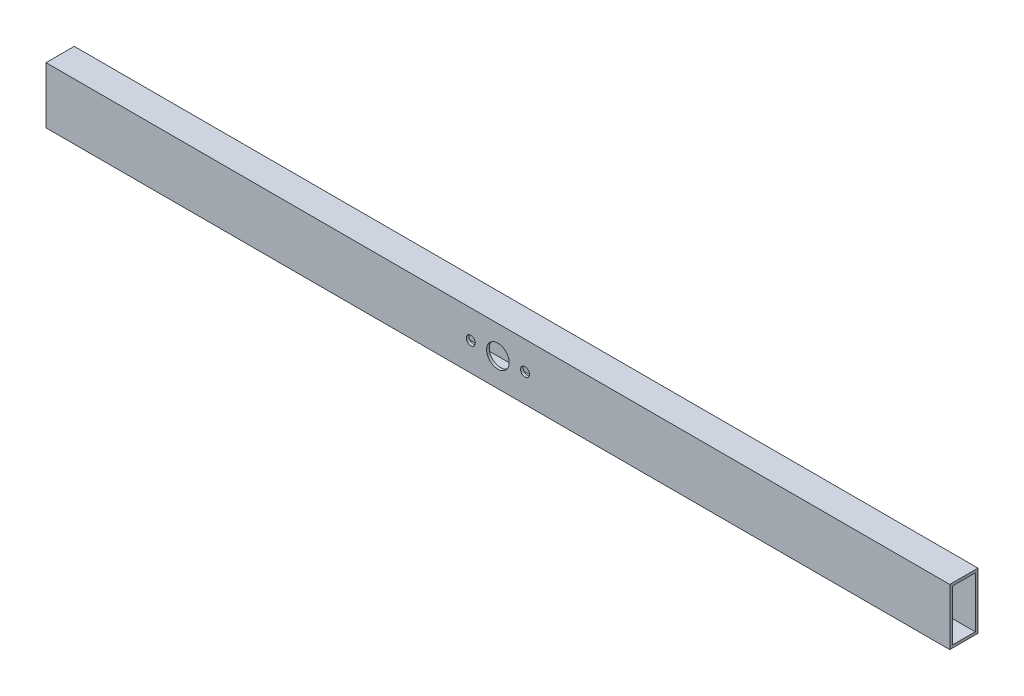
ISO-10303-21;
HEADER;
FILE_DESCRIPTION(('STEP AP214'),'2;1');
FILE_NAME('part.step','',(''),(''),'','','');
FILE_SCHEMA(('AUTOMOTIVE_DESIGN { 1 0 10303 214 1 1 1 1 }'));
ENDSEC;
DATA;
#1=APPLICATION_CONTEXT('core data for automotive mechanical design processes');
#2=APPLICATION_PROTOCOL_DEFINITION('international standard','automotive_design',2000,#1);
#3=PRODUCT_CONTEXT('',#1,'mechanical');
#4=PRODUCT('Part','Part','',(#3));
#5=PRODUCT_RELATED_PRODUCT_CATEGORY('part','',(#4));
#6=PRODUCT_DEFINITION_FORMATION('','',#4);
#7=PRODUCT_DEFINITION_CONTEXT('part definition',#1,'design');
#8=PRODUCT_DEFINITION('design','',#6,#7);
#9=PRODUCT_DEFINITION_SHAPE('','',#8);
#10=(LENGTH_UNIT() NAMED_UNIT(*) SI_UNIT(.MILLI.,.METRE.));
#11=(NAMED_UNIT(*) PLANE_ANGLE_UNIT() SI_UNIT($,.RADIAN.));
#12=(NAMED_UNIT(*) SI_UNIT($,.STERADIAN.) SOLID_ANGLE_UNIT());
#13=UNCERTAINTY_MEASURE_WITH_UNIT(LENGTH_MEASURE(1.E-05),#10,'distance_accuracy_value','');
#14=(GEOMETRIC_REPRESENTATION_CONTEXT(3) GLOBAL_UNCERTAINTY_ASSIGNED_CONTEXT((#13)) GLOBAL_UNIT_ASSIGNED_CONTEXT((#10,
#11,#12)) REPRESENTATION_CONTEXT('',''));
#15=CARTESIAN_POINT('',(0.,0.,0.));
#16=DIRECTION('',(0.,0.,1.));
#17=DIRECTION('',(1.,0.,0.));
#18=AXIS2_PLACEMENT_3D('',#15,#16,#17);
#19=CARTESIAN_POINT('',(400.,0.,0.));
#20=DIRECTION('',(-1.,0.,0.));
#21=DIRECTION('',(0.,0.,1.));
#22=AXIS2_PLACEMENT_3D('',#19,#20,#21);
#23=PLANE('',#22);
#24=DIRECTION('',(0.,1.,0.));
#25=VECTOR('',#24,1.);
#26=CARTESIAN_POINT('',(400.,-12.5,-6.25));
#27=LINE('',#26,#25);
#28=CARTESIAN_POINT('',(400.,-12.5,-6.25));
#29=VERTEX_POINT('',#28);
#30=CARTESIAN_POINT('',(400.,12.5,-6.25));
#31=VERTEX_POINT('',#30);
#32=EDGE_CURVE('E142',#29,#31,#27,.T.);
#33=ORIENTED_EDGE('',*,*,#32,.T.);
#34=DIRECTION('',(0.,0.,1.));
#35=VECTOR('',#34,1.);
#36=CARTESIAN_POINT('',(400.,12.5,6.25));
#37=LINE('',#36,#35);
#38=CARTESIAN_POINT('',(400.,12.5,6.25));
#39=VERTEX_POINT('',#38);
#40=EDGE_CURVE('E145',#31,#39,#37,.T.);
#41=ORIENTED_EDGE('',*,*,#40,.T.);
#42=DIRECTION('',(0.,-1.,0.));
#43=VECTOR('',#42,1.);
#44=CARTESIAN_POINT('',(400.,-12.5,6.25));
#45=LINE('',#44,#43);
#46=CARTESIAN_POINT('',(400.,-12.5,6.25));
#47=VERTEX_POINT('',#46);
#48=EDGE_CURVE('E148',#39,#47,#45,.T.);
#49=ORIENTED_EDGE('',*,*,#48,.T.);
#50=DIRECTION('',(0.,0.,-1.));
#51=VECTOR('',#50,1.);
#52=CARTESIAN_POINT('',(400.,-12.5,6.25));
#53=LINE('',#52,#51);
#54=EDGE_CURVE('E150',#47,#29,#53,.T.);
#55=ORIENTED_EDGE('',*,*,#54,.T.);
#56=EDGE_LOOP('',(#33,#41,#49,#55));
#57=FACE_BOUND('',#56,.T.);
#58=DIRECTION('',(0.,-1.,0.));
#59=VECTOR('',#58,1.);
#60=CARTESIAN_POINT('',(400.,-11.3,5.05));
#61=LINE('',#60,#59);
#62=CARTESIAN_POINT('',(400.,11.3,5.05));
#63=VERTEX_POINT('',#62);
#64=CARTESIAN_POINT('',(400.,-11.3,5.05));
#65=VERTEX_POINT('',#64);
#66=EDGE_CURVE('E104',#63,#65,#61,.T.);
#67=ORIENTED_EDGE('',*,*,#66,.F.);
#68=DIRECTION('',(0.,0.,1.));
#69=VECTOR('',#68,1.);
#70=CARTESIAN_POINT('',(400.,11.3,5.05));
#71=LINE('',#70,#69);
#72=CARTESIAN_POINT('',(400.,11.3,-5.05));
#73=VERTEX_POINT('',#72);
#74=EDGE_CURVE('E126',#73,#63,#71,.T.);
#75=ORIENTED_EDGE('',*,*,#74,.F.);
#76=DIRECTION('',(0.,1.,0.));
#77=VECTOR('',#76,1.);
#78=CARTESIAN_POINT('',(400.,-11.3,-5.05));
#79=LINE('',#78,#77);
#80=CARTESIAN_POINT('',(400.,-11.3,-5.05));
#81=VERTEX_POINT('',#80);
#82=EDGE_CURVE('E124',#81,#73,#79,.T.);
#83=ORIENTED_EDGE('',*,*,#82,.F.);
#84=DIRECTION('',(0.,0.,-1.));
#85=VECTOR('',#84,1.);
#86=CARTESIAN_POINT('',(400.,-11.3,5.05));
#87=LINE('',#86,#85);
#88=EDGE_CURVE('E112',#65,#81,#87,.T.);
#89=ORIENTED_EDGE('',*,*,#88,.F.);
#90=EDGE_LOOP('',(#67,#75,#83,#89));
#91=FACE_BOUND('',#90,.T.);
#92=ADVANCED_FACE('F37',(#57,#91),#23,.F.);
#93=CARTESIAN_POINT('',(0.,0.,0.));
#94=DIRECTION('',(-1.,0.,0.));
#95=DIRECTION('',(0.,0.,1.));
#96=AXIS2_PLACEMENT_3D('',#93,#94,#95);
#97=PLANE('',#96);
#98=DIRECTION('',(0.,1.,0.));
#99=VECTOR('',#98,1.);
#100=CARTESIAN_POINT('',(0.,-12.5,-6.25));
#101=LINE('',#100,#99);
#102=CARTESIAN_POINT('',(0.,-12.5,-6.25));
#103=VERTEX_POINT('',#102);
#104=CARTESIAN_POINT('',(0.,12.5,-6.25));
#105=VERTEX_POINT('',#104);
#106=EDGE_CURVE('E120',#103,#105,#101,.T.);
#107=ORIENTED_EDGE('',*,*,#106,.F.);
#108=DIRECTION('',(0.,0.,-1.));
#109=VECTOR('',#108,1.);
#110=CARTESIAN_POINT('',(0.,-12.5,6.25));
#111=LINE('',#110,#109);
#112=CARTESIAN_POINT('',(0.,-12.5,6.25));
#113=VERTEX_POINT('',#112);
#114=EDGE_CURVE('E146',#113,#103,#111,.T.);
#115=ORIENTED_EDGE('',*,*,#114,.F.);
#116=DIRECTION('',(0.,-1.,0.));
#117=VECTOR('',#116,1.);
#118=CARTESIAN_POINT('',(0.,-12.5,6.25));
#119=LINE('',#118,#117);
#120=CARTESIAN_POINT('',(0.,12.5,6.25));
#121=VERTEX_POINT('',#120);
#122=EDGE_CURVE('E157',#121,#113,#119,.T.);
#123=ORIENTED_EDGE('',*,*,#122,.F.);
#124=DIRECTION('',(0.,0.,1.));
#125=VECTOR('',#124,1.);
#126=CARTESIAN_POINT('',(0.,12.5,6.25));
#127=LINE('',#126,#125);
#128=EDGE_CURVE('E155',#105,#121,#127,.T.);
#129=ORIENTED_EDGE('',*,*,#128,.F.);
#130=EDGE_LOOP('',(#107,#115,#123,#129));
#131=FACE_BOUND('',#130,.T.);
#132=DIRECTION('',(0.,0.,1.));
#133=VECTOR('',#132,1.);
#134=CARTESIAN_POINT('',(0.,11.3,5.05));
#135=LINE('',#134,#133);
#136=CARTESIAN_POINT('',(0.,11.3,-5.05));
#137=VERTEX_POINT('',#136);
#138=CARTESIAN_POINT('',(0.,11.3,5.05));
#139=VERTEX_POINT('',#138);
#140=EDGE_CURVE('E113',#137,#139,#135,.T.);
#141=ORIENTED_EDGE('',*,*,#140,.T.);
#142=DIRECTION('',(0.,-1.,0.));
#143=VECTOR('',#142,1.);
#144=CARTESIAN_POINT('',(0.,-11.3,5.05));
#145=LINE('',#144,#143);
#146=CARTESIAN_POINT('',(0.,-11.3,5.05));
#147=VERTEX_POINT('',#146);
#148=EDGE_CURVE('E62',#139,#147,#145,.T.);
#149=ORIENTED_EDGE('',*,*,#148,.T.);
#150=DIRECTION('',(0.,0.,-1.));
#151=VECTOR('',#150,1.);
#152=CARTESIAN_POINT('',(0.,-11.3,5.05));
#153=LINE('',#152,#151);
#154=CARTESIAN_POINT('',(0.,-11.3,-5.05));
#155=VERTEX_POINT('',#154);
#156=EDGE_CURVE('E119',#147,#155,#153,.T.);
#157=ORIENTED_EDGE('',*,*,#156,.T.);
#158=DIRECTION('',(0.,1.,0.));
#159=VECTOR('',#158,1.);
#160=CARTESIAN_POINT('',(0.,-11.3,-5.05));
#161=LINE('',#160,#159);
#162=EDGE_CURVE('E134',#155,#137,#161,.T.);
#163=ORIENTED_EDGE('',*,*,#162,.T.);
#164=EDGE_LOOP('',(#141,#149,#157,#163));
#165=FACE_BOUND('',#164,.T.);
#166=ADVANCED_FACE('F215',(#131,#165),#97,.T.);
#167=CARTESIAN_POINT('',(400.,-12.5,-6.25));
#168=DIRECTION('',(0.,0.,1.));
#169=DIRECTION('',(1.,0.,0.));
#170=AXIS2_PLACEMENT_3D('',#167,#168,#169);
#171=PLANE('',#170);
#172=CARTESIAN_POINT('',(212.,0.,-6.25));
#173=DIRECTION('',(0.,0.,-1.));
#174=DIRECTION('',(-1.,0.,0.));
#175=AXIS2_PLACEMENT_3D('',#172,#173,#174);
#176=CIRCLE('',#175,2.);
#177=CARTESIAN_POINT('',(210.,0.,-6.25));
#178=VERTEX_POINT('',#177);
#179=EDGE_CURVE('E369',#178,#178,#176,.T.);
#180=ORIENTED_EDGE('',*,*,#179,.F.);
#181=EDGE_LOOP('',(#180));
#182=FACE_BOUND('',#181,.T.);
#183=CARTESIAN_POINT('',(188.,0.,-6.25));
#184=DIRECTION('',(0.,0.,-1.));
#185=DIRECTION('',(-1.,0.,0.));
#186=AXIS2_PLACEMENT_3D('',#183,#184,#185);
#187=CIRCLE('',#186,2.);
#188=CARTESIAN_POINT('',(186.,0.,-6.25));
#189=VERTEX_POINT('',#188);
#190=EDGE_CURVE('E367',#189,#189,#187,.T.);
#191=ORIENTED_EDGE('',*,*,#190,.F.);
#192=EDGE_LOOP('',(#191));
#193=FACE_BOUND('',#192,.T.);
#194=CARTESIAN_POINT('',(200.,0.,-6.25));
#195=DIRECTION('',(0.,0.,-1.));
#196=DIRECTION('',(-1.,0.,0.));
#197=AXIS2_PLACEMENT_3D('',#194,#195,#196);
#198=CIRCLE('',#197,4.99999999999999);
#199=CARTESIAN_POINT('',(195.,0.,-6.25));
#200=VERTEX_POINT('',#199);
#201=EDGE_CURVE('E170',#200,#200,#198,.T.);
#202=ORIENTED_EDGE('',*,*,#201,.F.);
#203=EDGE_LOOP('',(#202));
#204=FACE_BOUND('',#203,.T.);
#205=ORIENTED_EDGE('',*,*,#106,.T.);
#206=DIRECTION('',(-1.,0.,0.));
#207=VECTOR('',#206,1.);
#208=CARTESIAN_POINT('',(400.,12.5,-6.25));
#209=LINE('',#208,#207);
#210=EDGE_CURVE('E11',#31,#105,#209,.T.);
#211=ORIENTED_EDGE('',*,*,#210,.F.);
#212=ORIENTED_EDGE('',*,*,#32,.F.);
#213=DIRECTION('',(-1.,0.,0.));
#214=VECTOR('',#213,1.);
#215=CARTESIAN_POINT('',(400.,-12.5,-6.25));
#216=LINE('',#215,#214);
#217=EDGE_CURVE('E152',#29,#103,#216,.T.);
#218=ORIENTED_EDGE('',*,*,#217,.T.);
#219=EDGE_LOOP('',(#205,#211,#212,#218));
#220=FACE_BOUND('',#219,.T.);
#221=ADVANCED_FACE('F39',(#182,#193,#204,#220),#171,.F.);
#222=CARTESIAN_POINT('',(400.,12.5,6.25));
#223=DIRECTION('',(0.,-1.,0.));
#224=DIRECTION('',(0.,0.,-1.));
#225=AXIS2_PLACEMENT_3D('',#222,#223,#224);
#226=PLANE('',#225);
#227=ORIENTED_EDGE('',*,*,#128,.T.);
#228=DIRECTION('',(-1.,0.,0.));
#229=VECTOR('',#228,1.);
#230=CARTESIAN_POINT('',(400.,12.5,6.25));
#231=LINE('',#230,#229);
#232=EDGE_CURVE('E46',#39,#121,#231,.T.);
#233=ORIENTED_EDGE('',*,*,#232,.F.);
#234=ORIENTED_EDGE('',*,*,#40,.F.);
#235=ORIENTED_EDGE('',*,*,#210,.T.);
#236=EDGE_LOOP('',(#227,#233,#234,#235));
#237=FACE_BOUND('',#236,.T.);
#238=ADVANCED_FACE('F231',(#237),#226,.F.);
#239=CARTESIAN_POINT('',(400.,-12.5,6.25));
#240=DIRECTION('',(0.,0.,-1.));
#241=DIRECTION('',(-1.,0.,0.));
#242=AXIS2_PLACEMENT_3D('',#239,#240,#241);
#243=PLANE('',#242);
#244=CARTESIAN_POINT('',(212.,0.,6.25));
#245=DIRECTION('',(0.,0.,-1.));
#246=DIRECTION('',(-1.,0.,0.));
#247=AXIS2_PLACEMENT_3D('',#244,#245,#246);
#248=CIRCLE('',#247,2.);
#249=CARTESIAN_POINT('',(210.,0.,6.25));
#250=VERTEX_POINT('',#249);
#251=EDGE_CURVE('E132',#250,#250,#248,.T.);
#252=ORIENTED_EDGE('',*,*,#251,.T.);
#253=EDGE_LOOP('',(#252));
#254=FACE_BOUND('',#253,.T.);
#255=CARTESIAN_POINT('',(188.,0.,6.25));
#256=DIRECTION('',(0.,0.,-1.));
#257=DIRECTION('',(-1.,0.,0.));
#258=AXIS2_PLACEMENT_3D('',#255,#256,#257);
#259=CIRCLE('',#258,2.);
#260=CARTESIAN_POINT('',(186.,0.,6.25));
#261=VERTEX_POINT('',#260);
#262=EDGE_CURVE('E178',#261,#261,#259,.T.);
#263=ORIENTED_EDGE('',*,*,#262,.T.);
#264=EDGE_LOOP('',(#263));
#265=FACE_BOUND('',#264,.T.);
#266=CARTESIAN_POINT('',(200.,0.,6.25));
#267=DIRECTION('',(0.,0.,-1.));
#268=DIRECTION('',(-1.,0.,0.));
#269=AXIS2_PLACEMENT_3D('',#266,#267,#268);
#270=CIRCLE('',#269,4.99999999999999);
#271=CARTESIAN_POINT('',(195.,0.,6.25));
#272=VERTEX_POINT('',#271);
#273=EDGE_CURVE('E174',#272,#272,#270,.T.);
#274=ORIENTED_EDGE('',*,*,#273,.T.);
#275=EDGE_LOOP('',(#274));
#276=FACE_BOUND('',#275,.T.);
#277=ORIENTED_EDGE('',*,*,#122,.T.);
#278=DIRECTION('',(-1.,0.,0.));
#279=VECTOR('',#278,1.);
#280=CARTESIAN_POINT('',(400.,-12.5,6.25));
#281=LINE('',#280,#279);
#282=EDGE_CURVE('E162',#47,#113,#281,.T.);
#283=ORIENTED_EDGE('',*,*,#282,.F.);
#284=ORIENTED_EDGE('',*,*,#48,.F.);
#285=ORIENTED_EDGE('',*,*,#232,.T.);
#286=EDGE_LOOP('',(#277,#283,#284,#285));
#287=FACE_BOUND('',#286,.T.);
#288=ADVANCED_FACE('F195',(#254,#265,#276,#287),#243,.F.);
#289=CARTESIAN_POINT('',(400.,-12.5,6.25));
#290=DIRECTION('',(0.,1.,0.));
#291=DIRECTION('',(0.,0.,1.));
#292=AXIS2_PLACEMENT_3D('',#289,#290,#291);
#293=PLANE('',#292);
#294=ORIENTED_EDGE('',*,*,#114,.T.);
#295=ORIENTED_EDGE('',*,*,#217,.F.);
#296=ORIENTED_EDGE('',*,*,#54,.F.);
#297=ORIENTED_EDGE('',*,*,#282,.T.);
#298=EDGE_LOOP('',(#294,#295,#296,#297));
#299=FACE_BOUND('',#298,.T.);
#300=ADVANCED_FACE('F226',(#299),#293,.F.);
#301=CARTESIAN_POINT('',(400.,-11.3,5.05));
#302=DIRECTION('',(0.,0.,-1.));
#303=DIRECTION('',(0.,1.,0.));
#304=AXIS2_PLACEMENT_3D('',#301,#302,#303);
#305=PLANE('',#304);
#306=CARTESIAN_POINT('',(212.,0.,5.05));
#307=DIRECTION('',(0.,0.,-1.));
#308=DIRECTION('',(0.,1.,0.));
#309=AXIS2_PLACEMENT_3D('',#306,#307,#308);
#310=CIRCLE('',#309,2.);
#311=CARTESIAN_POINT('',(212.,2.,5.05));
#312=VERTEX_POINT('',#311);
#313=EDGE_CURVE('E190',#312,#312,#310,.T.);
#314=ORIENTED_EDGE('',*,*,#313,.F.);
#315=EDGE_LOOP('',(#314));
#316=FACE_BOUND('',#315,.T.);
#317=CARTESIAN_POINT('',(188.,0.,5.05));
#318=DIRECTION('',(0.,0.,-1.));
#319=DIRECTION('',(0.,1.,0.));
#320=AXIS2_PLACEMENT_3D('',#317,#318,#319);
#321=CIRCLE('',#320,2.);
#322=CARTESIAN_POINT('',(188.,2.,5.05));
#323=VERTEX_POINT('',#322);
#324=EDGE_CURVE('E173',#323,#323,#321,.T.);
#325=ORIENTED_EDGE('',*,*,#324,.F.);
#326=EDGE_LOOP('',(#325));
#327=FACE_BOUND('',#326,.T.);
#328=CARTESIAN_POINT('',(200.,0.,5.05));
#329=DIRECTION('',(0.,0.,-1.));
#330=DIRECTION('',(0.,1.,0.));
#331=AXIS2_PLACEMENT_3D('',#328,#329,#330);
#332=CIRCLE('',#331,4.99999999999999);
#333=CARTESIAN_POINT('',(200.,4.99999999999999,5.05));
#334=VERTEX_POINT('',#333);
#335=EDGE_CURVE('E169',#334,#334,#332,.T.);
#336=ORIENTED_EDGE('',*,*,#335,.F.);
#337=EDGE_LOOP('',(#336));
#338=FACE_BOUND('',#337,.T.);
#339=ORIENTED_EDGE('',*,*,#148,.F.);
#340=DIRECTION('',(-1.,0.,0.));
#341=VECTOR('',#340,1.);
#342=CARTESIAN_POINT('',(400.,11.3,5.05));
#343=LINE('',#342,#341);
#344=EDGE_CURVE('E108',#63,#139,#343,.T.);
#345=ORIENTED_EDGE('',*,*,#344,.F.);
#346=ORIENTED_EDGE('',*,*,#66,.T.);
#347=DIRECTION('',(-1.,0.,0.));
#348=VECTOR('',#347,1.);
#349=CARTESIAN_POINT('',(400.,-11.3,5.05));
#350=LINE('',#349,#348);
#351=EDGE_CURVE('E107',#65,#147,#350,.T.);
#352=ORIENTED_EDGE('',*,*,#351,.T.);
#353=EDGE_LOOP('',(#339,#345,#346,#352));
#354=FACE_BOUND('',#353,.T.);
#355=ADVANCED_FACE('F106',(#316,#327,#338,#354),#305,.T.);
#356=CARTESIAN_POINT('',(400.,-11.3,5.05));
#357=DIRECTION('',(0.,1.,0.));
#358=DIRECTION('',(0.,0.,1.));
#359=AXIS2_PLACEMENT_3D('',#356,#357,#358);
#360=PLANE('',#359);
#361=ORIENTED_EDGE('',*,*,#156,.F.);
#362=ORIENTED_EDGE('',*,*,#351,.F.);
#363=ORIENTED_EDGE('',*,*,#88,.T.);
#364=DIRECTION('',(-1.,0.,0.));
#365=VECTOR('',#364,1.);
#366=CARTESIAN_POINT('',(400.,-11.3,-5.05));
#367=LINE('',#366,#365);
#368=EDGE_CURVE('E121',#81,#155,#367,.T.);
#369=ORIENTED_EDGE('',*,*,#368,.T.);
#370=EDGE_LOOP('',(#361,#362,#363,#369));
#371=FACE_BOUND('',#370,.T.);
#372=ADVANCED_FACE('F116',(#371),#360,.T.);
#373=CARTESIAN_POINT('',(400.,-11.3,-5.05));
#374=DIRECTION('',(0.,0.,1.));
#375=DIRECTION('',(0.,-1.,0.));
#376=AXIS2_PLACEMENT_3D('',#373,#374,#375);
#377=PLANE('',#376);
#378=CARTESIAN_POINT('',(212.,0.,-5.05));
#379=DIRECTION('',(0.,0.,1.));
#380=DIRECTION('',(0.,-1.,0.));
#381=AXIS2_PLACEMENT_3D('',#378,#379,#380);
#382=CIRCLE('',#381,2.);
#383=CARTESIAN_POINT('',(212.,-1.99999999999999,-5.05));
#384=VERTEX_POINT('',#383);
#385=EDGE_CURVE('E41',#384,#384,#382,.T.);
#386=ORIENTED_EDGE('',*,*,#385,.F.);
#387=EDGE_LOOP('',(#386));
#388=FACE_BOUND('',#387,.T.);
#389=CARTESIAN_POINT('',(188.,0.,-5.05));
#390=DIRECTION('',(0.,0.,1.));
#391=DIRECTION('',(0.,-1.,0.));
#392=AXIS2_PLACEMENT_3D('',#389,#390,#391);
#393=CIRCLE('',#392,2.);
#394=CARTESIAN_POINT('',(188.,-1.99999999999999,-5.05));
#395=VERTEX_POINT('',#394);
#396=EDGE_CURVE('E171',#395,#395,#393,.T.);
#397=ORIENTED_EDGE('',*,*,#396,.F.);
#398=EDGE_LOOP('',(#397));
#399=FACE_BOUND('',#398,.T.);
#400=CARTESIAN_POINT('',(200.,0.,-5.05));
#401=DIRECTION('',(0.,0.,1.));
#402=DIRECTION('',(0.,-1.,0.));
#403=AXIS2_PLACEMENT_3D('',#400,#401,#402);
#404=CIRCLE('',#403,4.99999999999999);
#405=CARTESIAN_POINT('',(200.,-4.99999999999999,-5.05));
#406=VERTEX_POINT('',#405);
#407=EDGE_CURVE('E167',#406,#406,#404,.T.);
#408=ORIENTED_EDGE('',*,*,#407,.F.);
#409=EDGE_LOOP('',(#408));
#410=FACE_BOUND('',#409,.T.);
#411=ORIENTED_EDGE('',*,*,#162,.F.);
#412=ORIENTED_EDGE('',*,*,#368,.F.);
#413=ORIENTED_EDGE('',*,*,#82,.T.);
#414=DIRECTION('',(-1.,0.,0.));
#415=VECTOR('',#414,1.);
#416=CARTESIAN_POINT('',(400.,11.3,-5.05));
#417=LINE('',#416,#415);
#418=EDGE_CURVE('E54',#73,#137,#417,.T.);
#419=ORIENTED_EDGE('',*,*,#418,.T.);
#420=EDGE_LOOP('',(#411,#412,#413,#419));
#421=FACE_BOUND('',#420,.T.);
#422=ADVANCED_FACE('F255',(#388,#399,#410,#421),#377,.T.);
#423=CARTESIAN_POINT('',(400.,11.3,5.05));
#424=DIRECTION('',(0.,-1.,0.));
#425=DIRECTION('',(0.,0.,-1.));
#426=AXIS2_PLACEMENT_3D('',#423,#424,#425);
#427=PLANE('',#426);
#428=ORIENTED_EDGE('',*,*,#140,.F.);
#429=ORIENTED_EDGE('',*,*,#418,.F.);
#430=ORIENTED_EDGE('',*,*,#74,.T.);
#431=ORIENTED_EDGE('',*,*,#344,.T.);
#432=EDGE_LOOP('',(#428,#429,#430,#431));
#433=FACE_BOUND('',#432,.T.);
#434=ADVANCED_FACE('F252',(#433),#427,.T.);
#435=CARTESIAN_POINT('',(200.,0.,13.75));
#436=DIRECTION('',(0.,0.,-1.));
#437=DIRECTION('',(-1.,0.,0.));
#438=AXIS2_PLACEMENT_3D('',#435,#436,#437);
#439=CYLINDRICAL_SURFACE('',#438,4.99999999999999);
#440=ORIENTED_EDGE('',*,*,#407,.T.);
#441=EDGE_LOOP('',(#440));
#442=FACE_BOUND('',#441,.T.);
#443=ORIENTED_EDGE('',*,*,#201,.T.);
#444=EDGE_LOOP('',(#443));
#445=FACE_BOUND('',#444,.T.);
#446=ADVANCED_FACE('F254',(#442,#445),#439,.F.);
#447=CARTESIAN_POINT('',(188.,0.,13.75));
#448=DIRECTION('',(0.,0.,-1.));
#449=DIRECTION('',(-1.,0.,0.));
#450=AXIS2_PLACEMENT_3D('',#447,#448,#449);
#451=CYLINDRICAL_SURFACE('',#450,2.);
#452=ORIENTED_EDGE('',*,*,#396,.T.);
#453=EDGE_LOOP('',(#452));
#454=FACE_BOUND('',#453,.T.);
#455=ORIENTED_EDGE('',*,*,#190,.T.);
#456=EDGE_LOOP('',(#455));
#457=FACE_BOUND('',#456,.T.);
#458=ADVANCED_FACE('F210',(#454,#457),#451,.F.);
#459=CARTESIAN_POINT('',(212.,0.,13.75));
#460=DIRECTION('',(0.,0.,-1.));
#461=DIRECTION('',(-1.,0.,0.));
#462=AXIS2_PLACEMENT_3D('',#459,#460,#461);
#463=CYLINDRICAL_SURFACE('',#462,2.);
#464=ORIENTED_EDGE('',*,*,#385,.T.);
#465=EDGE_LOOP('',(#464));
#466=FACE_BOUND('',#465,.T.);
#467=ORIENTED_EDGE('',*,*,#179,.T.);
#468=EDGE_LOOP('',(#467));
#469=FACE_BOUND('',#468,.T.);
#470=ADVANCED_FACE('F203',(#466,#469),#463,.F.);
#471=ORIENTED_EDGE('',*,*,#335,.T.);
#472=EDGE_LOOP('',(#471));
#473=FACE_BOUND('',#472,.T.);
#474=ORIENTED_EDGE('',*,*,#273,.F.);
#475=EDGE_LOOP('',(#474));
#476=FACE_BOUND('',#475,.T.);
#477=ADVANCED_FACE('F207',(#473,#476),#439,.F.);
#478=ORIENTED_EDGE('',*,*,#324,.T.);
#479=EDGE_LOOP('',(#478));
#480=FACE_BOUND('',#479,.T.);
#481=ORIENTED_EDGE('',*,*,#262,.F.);
#482=EDGE_LOOP('',(#481));
#483=FACE_BOUND('',#482,.T.);
#484=ADVANCED_FACE('F200',(#480,#483),#451,.F.);
#485=ORIENTED_EDGE('',*,*,#313,.T.);
#486=EDGE_LOOP('',(#485));
#487=FACE_BOUND('',#486,.T.);
#488=ORIENTED_EDGE('',*,*,#251,.F.);
#489=EDGE_LOOP('',(#488));
#490=FACE_BOUND('',#489,.T.);
#491=ADVANCED_FACE('F198',(#487,#490),#463,.F.);
#492=CLOSED_SHELL('',(#92,#166,#221,#238,#288,#300,#355,#372,#422,#434,#446,#458,#470,#477,#484,#491));
#493=MANIFOLD_SOLID_BREP('B2',#492);
#494=ADVANCED_BREP_SHAPE_REPRESENTATION('',(#18,#493),#14);
#495=SHAPE_DEFINITION_REPRESENTATION(#9,#494);
ENDSEC;
END-ISO-10303-21;
